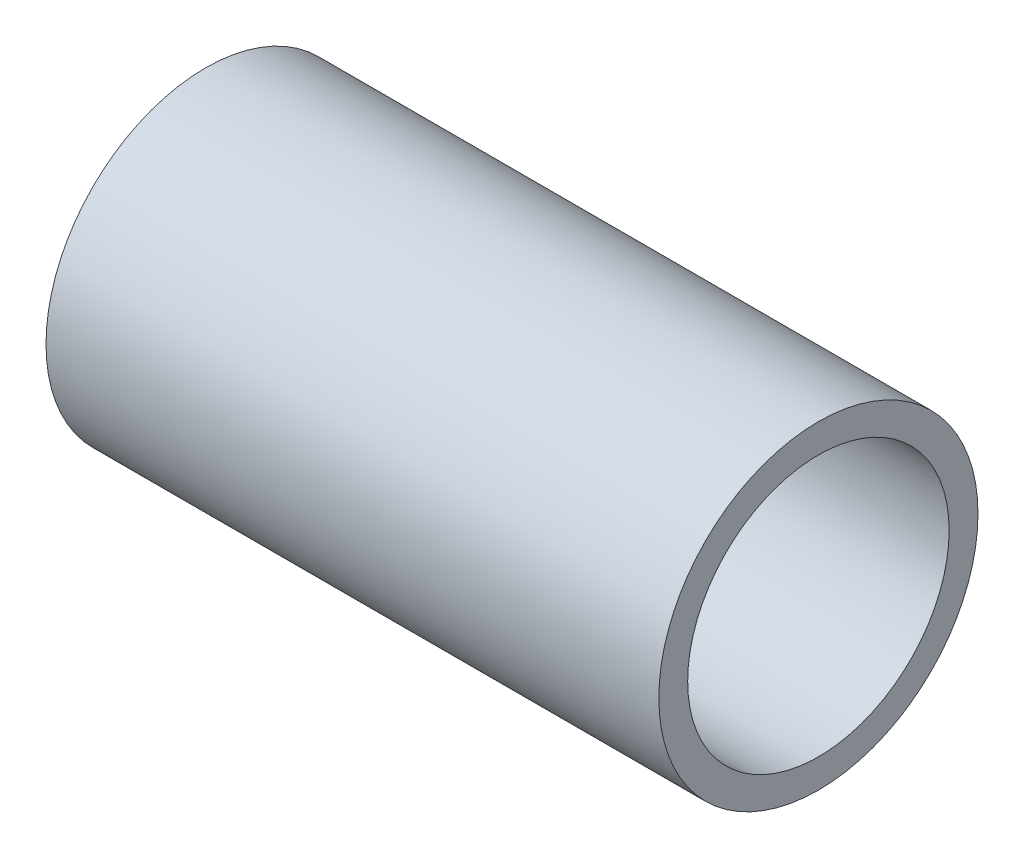
ISO-10303-21;
HEADER;
FILE_DESCRIPTION(('STEP AP214'),'2;1');
FILE_NAME('part.step','',(''),(''),'','','');
FILE_SCHEMA(('AUTOMOTIVE_DESIGN { 1 0 10303 214 1 1 1 1 }'));
ENDSEC;
DATA;
#1=APPLICATION_CONTEXT('core data for automotive mechanical design processes');
#2=APPLICATION_PROTOCOL_DEFINITION('international standard','automotive_design',2000,#1);
#3=PRODUCT_CONTEXT('',#1,'mechanical');
#4=PRODUCT('Part','Part','',(#3));
#5=PRODUCT_RELATED_PRODUCT_CATEGORY('part','',(#4));
#6=PRODUCT_DEFINITION_FORMATION('','',#4);
#7=PRODUCT_DEFINITION_CONTEXT('part definition',#1,'design');
#8=PRODUCT_DEFINITION('design','',#6,#7);
#9=PRODUCT_DEFINITION_SHAPE('','',#8);
#10=(LENGTH_UNIT() NAMED_UNIT(*) SI_UNIT(.MILLI.,.METRE.));
#11=(NAMED_UNIT(*) PLANE_ANGLE_UNIT() SI_UNIT($,.RADIAN.));
#12=(NAMED_UNIT(*) SI_UNIT($,.STERADIAN.) SOLID_ANGLE_UNIT());
#13=UNCERTAINTY_MEASURE_WITH_UNIT(LENGTH_MEASURE(1.E-05),#10,'distance_accuracy_value','');
#14=(GEOMETRIC_REPRESENTATION_CONTEXT(3) GLOBAL_UNCERTAINTY_ASSIGNED_CONTEXT((#13)) GLOBAL_UNIT_ASSIGNED_CONTEXT((#10,
#11,#12)) REPRESENTATION_CONTEXT('',''));
#15=CARTESIAN_POINT('',(0.,0.,0.));
#16=DIRECTION('',(0.,0.,1.));
#17=DIRECTION('',(1.,0.,0.));
#18=AXIS2_PLACEMENT_3D('',#15,#16,#17);
#19=CARTESIAN_POINT('',(7.62,0.,0.));
#20=DIRECTION('',(1.,0.,0.));
#21=DIRECTION('',(0.,0.,-1.));
#22=AXIS2_PLACEMENT_3D('',#19,#20,#21);
#23=PLANE('',#22);
#24=CARTESIAN_POINT('',(7.62,0.,0.));
#25=DIRECTION('',(1.,0.,0.));
#26=DIRECTION('',(0.,0.,-1.));
#27=AXIS2_PLACEMENT_3D('',#24,#25,#26);
#28=CIRCLE('',#27,1.984375);
#29=CARTESIAN_POINT('',(7.62,0.,-1.984375));
#30=VERTEX_POINT('',#29);
#31=EDGE_CURVE('E10',#30,#30,#28,.T.);
#32=ORIENTED_EDGE('',*,*,#31,.T.);
#33=EDGE_LOOP('',(#32));
#34=FACE_BOUND('',#33,.T.);
#35=CARTESIAN_POINT('',(7.62,0.,0.));
#36=DIRECTION('',(1.,0.,0.));
#37=DIRECTION('',(0.,0.,-1.));
#38=AXIS2_PLACEMENT_3D('',#35,#36,#37);
#39=CIRCLE('',#38,1.6256);
#40=CARTESIAN_POINT('',(7.62,0.,-1.6256));
#41=VERTEX_POINT('',#40);
#42=EDGE_CURVE('E41',#41,#41,#39,.T.);
#43=ORIENTED_EDGE('',*,*,#42,.F.);
#44=EDGE_LOOP('',(#43));
#45=FACE_BOUND('',#44,.T.);
#46=ADVANCED_FACE('F30',(#34,#45),#23,.T.);
#47=CARTESIAN_POINT('',(0.,0.,0.));
#48=DIRECTION('',(1.,0.,0.));
#49=DIRECTION('',(0.,0.,-1.));
#50=AXIS2_PLACEMENT_3D('',#47,#48,#49);
#51=PLANE('',#50);
#52=CARTESIAN_POINT('',(0.,0.,0.));
#53=DIRECTION('',(1.,0.,0.));
#54=DIRECTION('',(0.,0.,-1.));
#55=AXIS2_PLACEMENT_3D('',#52,#53,#54);
#56=CIRCLE('',#55,1.984375);
#57=CARTESIAN_POINT('',(0.,0.,-1.984375));
#58=VERTEX_POINT('',#57);
#59=EDGE_CURVE('E34',#58,#58,#56,.T.);
#60=ORIENTED_EDGE('',*,*,#59,.F.);
#61=EDGE_LOOP('',(#60));
#62=FACE_BOUND('',#61,.T.);
#63=CARTESIAN_POINT('',(0.,0.,0.));
#64=DIRECTION('',(1.,0.,0.));
#65=DIRECTION('',(0.,0.,-1.));
#66=AXIS2_PLACEMENT_3D('',#63,#64,#65);
#67=CIRCLE('',#66,1.6256);
#68=CARTESIAN_POINT('',(0.,0.,-1.6256));
#69=VERTEX_POINT('',#68);
#70=EDGE_CURVE('E43',#69,#69,#67,.T.);
#71=ORIENTED_EDGE('',*,*,#70,.T.);
#72=EDGE_LOOP('',(#71));
#73=FACE_BOUND('',#72,.T.);
#74=ADVANCED_FACE('F53',(#62,#73),#51,.F.);
#75=CARTESIAN_POINT('',(7.62,0.,0.));
#76=DIRECTION('',(-1.,0.,0.));
#77=DIRECTION('',(0.,0.,1.));
#78=AXIS2_PLACEMENT_3D('',#75,#76,#77);
#79=CYLINDRICAL_SURFACE('',#78,1.984375);
#80=ORIENTED_EDGE('',*,*,#31,.F.);
#81=EDGE_LOOP('',(#80));
#82=FACE_BOUND('',#81,.T.);
#83=ORIENTED_EDGE('',*,*,#59,.T.);
#84=EDGE_LOOP('',(#83));
#85=FACE_BOUND('',#84,.T.);
#86=ADVANCED_FACE('F32',(#82,#85),#79,.T.);
#87=CARTESIAN_POINT('',(7.62,0.,0.));
#88=DIRECTION('',(-1.,0.,0.));
#89=DIRECTION('',(0.,0.,1.));
#90=AXIS2_PLACEMENT_3D('',#87,#88,#89);
#91=CYLINDRICAL_SURFACE('',#90,1.6256);
#92=ORIENTED_EDGE('',*,*,#42,.T.);
#93=EDGE_LOOP('',(#92));
#94=FACE_BOUND('',#93,.T.);
#95=ORIENTED_EDGE('',*,*,#70,.F.);
#96=EDGE_LOOP('',(#95));
#97=FACE_BOUND('',#96,.T.);
#98=ADVANCED_FACE('F49',(#94,#97),#91,.F.);
#99=CLOSED_SHELL('',(#46,#74,#86,#98));
#100=MANIFOLD_SOLID_BREP('B2',#99);
#101=ADVANCED_BREP_SHAPE_REPRESENTATION('',(#18,#100),#14);
#102=SHAPE_DEFINITION_REPRESENTATION(#9,#101);
ENDSEC;
END-ISO-10303-21;
